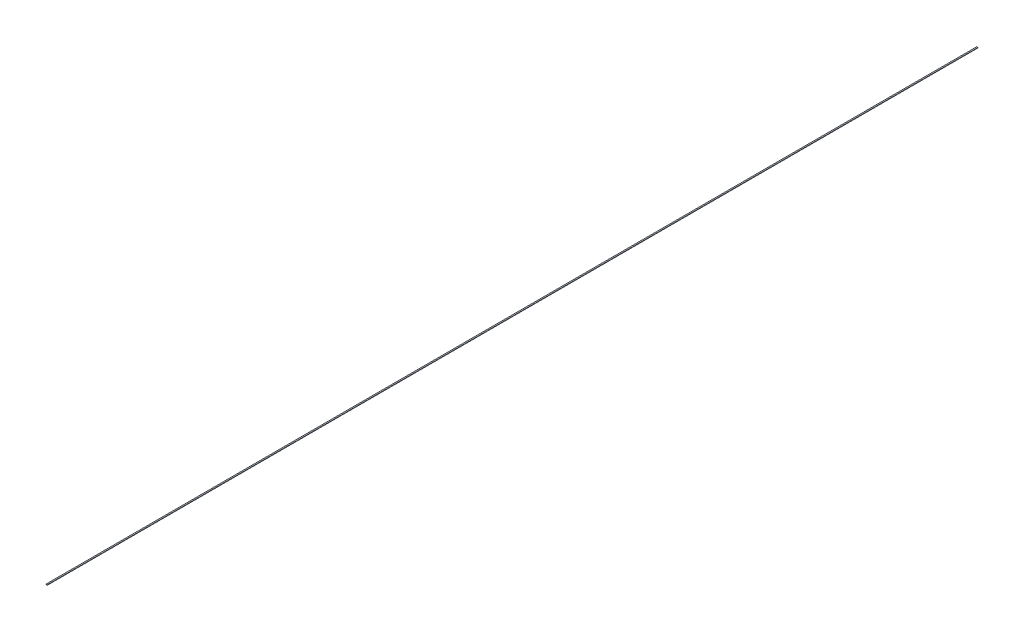
ISO-10303-21;
HEADER;
FILE_DESCRIPTION(('STEP AP214'),'2;1');
FILE_NAME('part.step','',(''),(''),'','','');
FILE_SCHEMA(('AUTOMOTIVE_DESIGN { 1 0 10303 214 1 1 1 1 }'));
ENDSEC;
DATA;
#1=APPLICATION_CONTEXT('core data for automotive mechanical design processes');
#2=APPLICATION_PROTOCOL_DEFINITION('international standard','automotive_design',2000,#1);
#3=PRODUCT_CONTEXT('',#1,'mechanical');
#4=PRODUCT('Part','Part','',(#3));
#5=PRODUCT_RELATED_PRODUCT_CATEGORY('part','',(#4));
#6=PRODUCT_DEFINITION_FORMATION('','',#4);
#7=PRODUCT_DEFINITION_CONTEXT('part definition',#1,'design');
#8=PRODUCT_DEFINITION('design','',#6,#7);
#9=PRODUCT_DEFINITION_SHAPE('','',#8);
#10=(LENGTH_UNIT() NAMED_UNIT(*) SI_UNIT(.MILLI.,.METRE.));
#11=(NAMED_UNIT(*) PLANE_ANGLE_UNIT() SI_UNIT($,.RADIAN.));
#12=(NAMED_UNIT(*) SI_UNIT($,.STERADIAN.) SOLID_ANGLE_UNIT());
#13=UNCERTAINTY_MEASURE_WITH_UNIT(LENGTH_MEASURE(1.E-05),#10,'distance_accuracy_value','');
#14=(GEOMETRIC_REPRESENTATION_CONTEXT(3) GLOBAL_UNCERTAINTY_ASSIGNED_CONTEXT((#13)) GLOBAL_UNIT_ASSIGNED_CONTEXT((#10,
#11,#12)) REPRESENTATION_CONTEXT('',''));
#15=CARTESIAN_POINT('',(0.,0.,0.));
#16=DIRECTION('',(0.,0.,1.));
#17=DIRECTION('',(1.,0.,0.));
#18=AXIS2_PLACEMENT_3D('',#15,#16,#17);
#19=CARTESIAN_POINT('',(0.,0.,450.));
#20=DIRECTION('',(1.,0.,0.));
#21=DIRECTION('',(0.,0.,-1.));
#22=AXIS2_PLACEMENT_3D('',#19,#20,#21);
#23=PLANE('',#22);
#24=DIRECTION('',(0.,-1.,0.));
#25=VECTOR('',#24,1.);
#26=CARTESIAN_POINT('',(0.,0.,0.));
#27=LINE('',#26,#25);
#28=CARTESIAN_POINT('',(0.,0.2,0.));
#29=VERTEX_POINT('',#28);
#30=CARTESIAN_POINT('',(0.,0.,0.));
#31=VERTEX_POINT('',#30);
#32=EDGE_CURVE('E107',#29,#31,#27,.T.);
#33=ORIENTED_EDGE('',*,*,#32,.T.);
#34=DIRECTION('',(0.,0.,-1.));
#35=VECTOR('',#34,1.);
#36=CARTESIAN_POINT('',(0.,0.,450.));
#37=LINE('',#36,#35);
#38=CARTESIAN_POINT('',(0.,0.,450.));
#39=VERTEX_POINT('',#38);
#40=EDGE_CURVE('E11',#39,#31,#37,.T.);
#41=ORIENTED_EDGE('',*,*,#40,.F.);
#42=DIRECTION('',(0.,-1.,0.));
#43=VECTOR('',#42,1.);
#44=CARTESIAN_POINT('',(0.,0.,450.));
#45=LINE('',#44,#43);
#46=CARTESIAN_POINT('',(0.,0.2,450.));
#47=VERTEX_POINT('',#46);
#48=EDGE_CURVE('E91',#47,#39,#45,.T.);
#49=ORIENTED_EDGE('',*,*,#48,.F.);
#50=DIRECTION('',(0.,0.,-1.));
#51=VECTOR('',#50,1.);
#52=CARTESIAN_POINT('',(0.,0.2,450.));
#53=LINE('',#52,#51);
#54=EDGE_CURVE('E103',#47,#29,#53,.T.);
#55=ORIENTED_EDGE('',*,*,#54,.T.);
#56=EDGE_LOOP('',(#33,#41,#49,#55));
#57=FACE_BOUND('',#56,.T.);
#58=ADVANCED_FACE('F39',(#57),#23,.F.);
#59=CARTESIAN_POINT('',(0.,0.,450.));
#60=DIRECTION('',(0.,1.,0.));
#61=DIRECTION('',(0.,0.,1.));
#62=AXIS2_PLACEMENT_3D('',#59,#60,#61);
#63=PLANE('',#62);
#64=DIRECTION('',(1.,0.,0.));
#65=VECTOR('',#64,1.);
#66=CARTESIAN_POINT('',(0.,0.,0.));
#67=LINE('',#66,#65);
#68=CARTESIAN_POINT('',(0.6,0.,0.));
#69=VERTEX_POINT('',#68);
#70=EDGE_CURVE('E96',#31,#69,#67,.T.);
#71=ORIENTED_EDGE('',*,*,#70,.T.);
#72=DIRECTION('',(0.,0.,-1.));
#73=VECTOR('',#72,1.);
#74=CARTESIAN_POINT('',(0.6,0.,450.));
#75=LINE('',#74,#73);
#76=CARTESIAN_POINT('',(0.6,0.,450.));
#77=VERTEX_POINT('',#76);
#78=EDGE_CURVE('E48',#77,#69,#75,.T.);
#79=ORIENTED_EDGE('',*,*,#78,.F.);
#80=DIRECTION('',(1.,0.,0.));
#81=VECTOR('',#80,1.);
#82=CARTESIAN_POINT('',(0.,0.,450.));
#83=LINE('',#82,#81);
#84=EDGE_CURVE('E86',#39,#77,#83,.T.);
#85=ORIENTED_EDGE('',*,*,#84,.F.);
#86=ORIENTED_EDGE('',*,*,#40,.T.);
#87=EDGE_LOOP('',(#71,#79,#85,#86));
#88=FACE_BOUND('',#87,.T.);
#89=ADVANCED_FACE('F95',(#88),#63,.F.);
#90=CARTESIAN_POINT('',(0.6,0.,450.));
#91=DIRECTION('',(-1.,0.,0.));
#92=DIRECTION('',(0.,0.,1.));
#93=AXIS2_PLACEMENT_3D('',#90,#91,#92);
#94=PLANE('',#93);
#95=DIRECTION('',(0.,1.,0.));
#96=VECTOR('',#95,1.);
#97=CARTESIAN_POINT('',(0.6,0.,0.));
#98=LINE('',#97,#96);
#99=CARTESIAN_POINT('',(0.6,0.2,0.));
#100=VERTEX_POINT('',#99);
#101=EDGE_CURVE('E73',#69,#100,#98,.T.);
#102=ORIENTED_EDGE('',*,*,#101,.T.);
#103=DIRECTION('',(0.,0.,-1.));
#104=VECTOR('',#103,1.);
#105=CARTESIAN_POINT('',(0.6,0.2,450.));
#106=LINE('',#105,#104);
#107=CARTESIAN_POINT('',(0.6,0.2,450.));
#108=VERTEX_POINT('',#107);
#109=EDGE_CURVE('E98',#108,#100,#106,.T.);
#110=ORIENTED_EDGE('',*,*,#109,.F.);
#111=DIRECTION('',(0.,1.,0.));
#112=VECTOR('',#111,1.);
#113=CARTESIAN_POINT('',(0.6,0.,450.));
#114=LINE('',#113,#112);
#115=EDGE_CURVE('E89',#77,#108,#114,.T.);
#116=ORIENTED_EDGE('',*,*,#115,.F.);
#117=ORIENTED_EDGE('',*,*,#78,.T.);
#118=EDGE_LOOP('',(#102,#110,#116,#117));
#119=FACE_BOUND('',#118,.T.);
#120=ADVANCED_FACE('F99',(#119),#94,.F.);
#121=CARTESIAN_POINT('',(0.,0.2,450.));
#122=DIRECTION('',(0.,-1.,0.));
#123=DIRECTION('',(0.,0.,-1.));
#124=AXIS2_PLACEMENT_3D('',#121,#122,#123);
#125=PLANE('',#124);
#126=DIRECTION('',(-1.,0.,0.));
#127=VECTOR('',#126,1.);
#128=CARTESIAN_POINT('',(0.,0.2,0.));
#129=LINE('',#128,#127);
#130=EDGE_CURVE('E79',#100,#29,#129,.T.);
#131=ORIENTED_EDGE('',*,*,#130,.T.);
#132=ORIENTED_EDGE('',*,*,#54,.F.);
#133=DIRECTION('',(-1.,0.,0.));
#134=VECTOR('',#133,1.);
#135=CARTESIAN_POINT('',(0.,0.2,450.));
#136=LINE('',#135,#134);
#137=EDGE_CURVE('E56',#108,#47,#136,.T.);
#138=ORIENTED_EDGE('',*,*,#137,.F.);
#139=ORIENTED_EDGE('',*,*,#109,.T.);
#140=EDGE_LOOP('',(#131,#132,#138,#139));
#141=FACE_BOUND('',#140,.T.);
#142=ADVANCED_FACE('F120',(#141),#125,.F.);
#143=CARTESIAN_POINT('',(0.,0.,450.));
#144=DIRECTION('',(0.,0.,-1.));
#145=DIRECTION('',(-1.,0.,0.));
#146=AXIS2_PLACEMENT_3D('',#143,#144,#145);
#147=PLANE('',#146);
#148=ORIENTED_EDGE('',*,*,#48,.T.);
#149=ORIENTED_EDGE('',*,*,#84,.T.);
#150=ORIENTED_EDGE('',*,*,#115,.T.);
#151=ORIENTED_EDGE('',*,*,#137,.T.);
#152=EDGE_LOOP('',(#148,#149,#150,#151));
#153=FACE_BOUND('',#152,.T.);
#154=ADVANCED_FACE('F87',(#153),#147,.F.);
#155=CARTESIAN_POINT('',(0.,0.,0.));
#156=DIRECTION('',(0.,0.,-1.));
#157=DIRECTION('',(-1.,0.,0.));
#158=AXIS2_PLACEMENT_3D('',#155,#156,#157);
#159=PLANE('',#158);
#160=ORIENTED_EDGE('',*,*,#32,.F.);
#161=ORIENTED_EDGE('',*,*,#130,.F.);
#162=ORIENTED_EDGE('',*,*,#101,.F.);
#163=ORIENTED_EDGE('',*,*,#70,.F.);
#164=EDGE_LOOP('',(#160,#161,#162,#163));
#165=FACE_BOUND('',#164,.T.);
#166=ADVANCED_FACE('F123',(#165),#159,.T.);
#167=CLOSED_SHELL('',(#58,#89,#120,#142,#154,#166));
#168=MANIFOLD_SOLID_BREP('B2',#167);
#169=ADVANCED_BREP_SHAPE_REPRESENTATION('',(#18,#168),#14);
#170=SHAPE_DEFINITION_REPRESENTATION(#9,#169);
ENDSEC;
END-ISO-10303-21;
